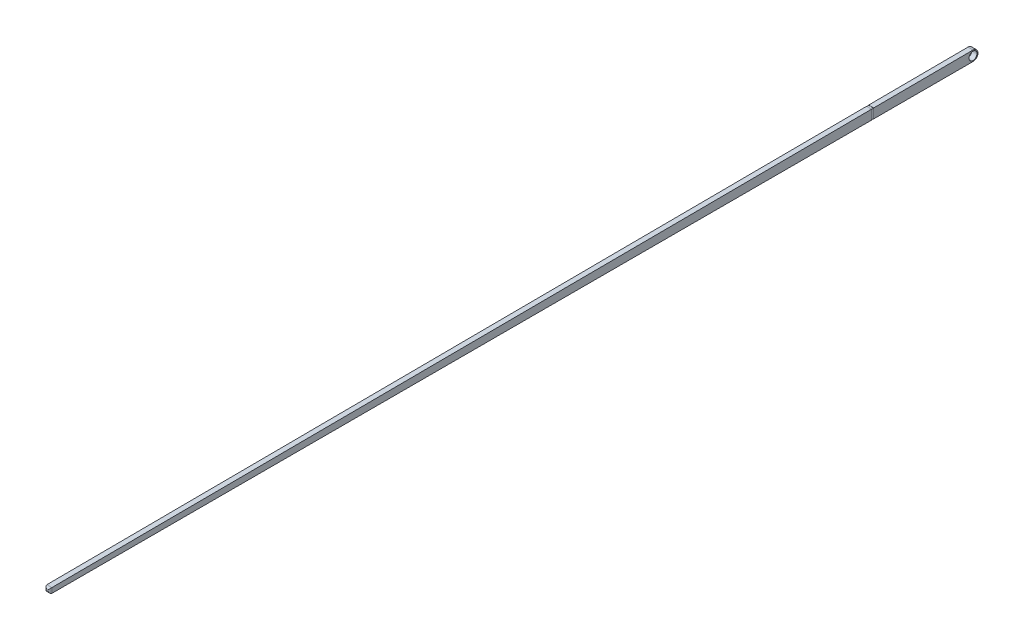
ISO-10303-21;
HEADER;
FILE_DESCRIPTION(('STEP AP214'),'2;1');
FILE_NAME('part.step','',(''),(''),'','','');
FILE_SCHEMA(('AUTOMOTIVE_DESIGN { 1 0 10303 214 1 1 1 1 }'));
ENDSEC;
DATA;
#1=APPLICATION_CONTEXT('core data for automotive mechanical design processes');
#2=APPLICATION_PROTOCOL_DEFINITION('international standard','automotive_design',2000,#1);
#3=PRODUCT_CONTEXT('',#1,'mechanical');
#4=PRODUCT('Part','Part','',(#3));
#5=PRODUCT_RELATED_PRODUCT_CATEGORY('part','',(#4));
#6=PRODUCT_DEFINITION_FORMATION('','',#4);
#7=PRODUCT_DEFINITION_CONTEXT('part definition',#1,'design');
#8=PRODUCT_DEFINITION('design','',#6,#7);
#9=PRODUCT_DEFINITION_SHAPE('','',#8);
#10=(LENGTH_UNIT() NAMED_UNIT(*) SI_UNIT(.MILLI.,.METRE.));
#11=(NAMED_UNIT(*) PLANE_ANGLE_UNIT() SI_UNIT($,.RADIAN.));
#12=(NAMED_UNIT(*) SI_UNIT($,.STERADIAN.) SOLID_ANGLE_UNIT());
#13=UNCERTAINTY_MEASURE_WITH_UNIT(LENGTH_MEASURE(1.E-05),#10,'distance_accuracy_value','');
#14=(GEOMETRIC_REPRESENTATION_CONTEXT(3) GLOBAL_UNCERTAINTY_ASSIGNED_CONTEXT((#13)) GLOBAL_UNIT_ASSIGNED_CONTEXT((#10,
#11,#12)) REPRESENTATION_CONTEXT('',''));
#15=CARTESIAN_POINT('',(0.,0.,0.));
#16=DIRECTION('',(0.,0.,1.));
#17=DIRECTION('',(1.,0.,0.));
#18=AXIS2_PLACEMENT_3D('',#15,#16,#17);
#19=CARTESIAN_POINT('',(0.3175,0.,0.));
#20=DIRECTION('',(-1.,0.,0.));
#21=DIRECTION('',(0.,0.,1.));
#22=AXIS2_PLACEMENT_3D('',#19,#20,#21);
#23=PLANE('',#22);
#24=DIRECTION('',(0.,-1.,0.));
#25=VECTOR('',#24,1.);
#26=CARTESIAN_POINT('',(0.3175,0.,12.827));
#27=LINE('',#26,#25);
#28=CARTESIAN_POINT('',(0.3175,0.56529639208067,12.827));
#29=VERTEX_POINT('',#28);
#30=CARTESIAN_POINT('',(0.3175,-0.635000000000002,12.827));
#31=VERTEX_POINT('',#30);
#32=EDGE_CURVE('E57',#29,#31,#27,.T.);
#33=ORIENTED_EDGE('',*,*,#32,.F.);
#34=DIRECTION('',(0.,-0.00543478260869578,0.999985231459943));
#35=VECTOR('',#34,1.);
#36=CARTESIAN_POINT('',(0.3175,0.634990621977064,0.00345108695652175));
#37=LINE('',#36,#35);
#38=CARTESIAN_POINT('',(0.3175,0.00138045516990203,116.586));
#39=VERTEX_POINT('',#38);
#40=EDGE_CURVE('E214',#29,#39,#37,.T.);
#41=ORIENTED_EDGE('',*,*,#40,.T.);
#42=DIRECTION('',(0.,-1.,0.));
#43=VECTOR('',#42,1.);
#44=CARTESIAN_POINT('',(0.3175,0.,116.586));
#45=LINE('',#44,#43);
#46=CARTESIAN_POINT('',(0.3175,-0.635000000000014,116.586));
#47=VERTEX_POINT('',#46);
#48=EDGE_CURVE('E246',#39,#47,#45,.T.);
#49=ORIENTED_EDGE('',*,*,#48,.T.);
#50=DIRECTION('',(0.,0.,-1.));
#51=VECTOR('',#50,1.);
#52=CARTESIAN_POINT('',(0.3175,-0.635,0.));
#53=LINE('',#52,#51);
#54=EDGE_CURVE('E215',#47,#31,#53,.T.);
#55=ORIENTED_EDGE('',*,*,#54,.T.);
#56=EDGE_LOOP('',(#33,#41,#49,#55));
#57=FACE_BOUND('',#56,.T.);
#58=ADVANCED_FACE('F35',(#57),#23,.F.);
#59=CARTESIAN_POINT('',(-0.3175,0.,0.));
#60=DIRECTION('',(-1.,0.,0.));
#61=DIRECTION('',(0.,0.,1.));
#62=AXIS2_PLACEMENT_3D('',#59,#60,#61);
#63=PLANE('',#62);
#64=DIRECTION('',(0.,-0.00543478260869578,0.999985231459943));
#65=VECTOR('',#64,1.);
#66=CARTESIAN_POINT('',(-0.3175,0.634990621977064,0.00345108695652175));
#67=LINE('',#66,#65);
#68=CARTESIAN_POINT('',(-0.3175,0.56529639208067,12.827));
#69=VERTEX_POINT('',#68);
#70=CARTESIAN_POINT('',(-0.3175,0.00138045516990203,116.586));
#71=VERTEX_POINT('',#70);
#72=EDGE_CURVE('E226',#69,#71,#67,.T.);
#73=ORIENTED_EDGE('',*,*,#72,.F.);
#74=DIRECTION('',(0.,-1.,0.));
#75=VECTOR('',#74,1.);
#76=CARTESIAN_POINT('',(-0.3175,0.,12.827));
#77=LINE('',#76,#75);
#78=CARTESIAN_POINT('',(-0.3175,-0.635000000000002,12.827));
#79=VERTEX_POINT('',#78);
#80=EDGE_CURVE('E180',#69,#79,#77,.T.);
#81=ORIENTED_EDGE('',*,*,#80,.T.);
#82=DIRECTION('',(0.,0.,-1.));
#83=VECTOR('',#82,1.);
#84=CARTESIAN_POINT('',(-0.3175,-0.635,0.));
#85=LINE('',#84,#83);
#86=CARTESIAN_POINT('',(-0.3175,-0.635000000000014,116.586));
#87=VERTEX_POINT('',#86);
#88=EDGE_CURVE('E209',#87,#79,#85,.T.);
#89=ORIENTED_EDGE('',*,*,#88,.F.);
#90=DIRECTION('',(0.,-1.,0.));
#91=VECTOR('',#90,1.);
#92=CARTESIAN_POINT('',(-0.3175,0.,116.586));
#93=LINE('',#92,#91);
#94=EDGE_CURVE('E250',#87,#71,#93,.F.);
#95=ORIENTED_EDGE('',*,*,#94,.T.);
#96=EDGE_LOOP('',(#73,#81,#89,#95));
#97=FACE_BOUND('',#96,.T.);
#98=ADVANCED_FACE('F267',(#97),#63,.T.);
#99=CARTESIAN_POINT('',(0.3175,0.634990621977064,0.00345108695652175));
#100=DIRECTION('',(0.,-0.999985231459943,-0.00543478260869578));
#101=DIRECTION('',(0.,0.00543478260869578,-0.999985231459943));
#102=AXIS2_PLACEMENT_3D('',#99,#100,#101);
#103=PLANE('',#102);
#104=DIRECTION('',(1.,0.,0.));
#105=VECTOR('',#104,1.);
#106=CARTESIAN_POINT('',(0.3175,0.56529639208067,12.827));
#107=LINE('',#106,#105);
#108=EDGE_CURVE('E187',#69,#29,#107,.T.);
#109=ORIENTED_EDGE('',*,*,#108,.F.);
#110=ORIENTED_EDGE('',*,*,#72,.T.);
#111=CARTESIAN_POINT('',(-0.3175,0.00137295269615246,116.587380434783));
#112=VERTEX_POINT('',#111);
#113=EDGE_CURVE('E221',#71,#112,#67,.T.);
#114=ORIENTED_EDGE('',*,*,#113,.T.);
#115=DIRECTION('',(-1.,0.,0.));
#116=VECTOR('',#115,1.);
#117=CARTESIAN_POINT('',(0.3175,0.00137295269615246,116.587380434783));
#118=LINE('',#117,#116);
#119=CARTESIAN_POINT('',(0.3175,0.00137295269615246,116.587380434783));
#120=VERTEX_POINT('',#119);
#121=EDGE_CURVE('E243',#112,#120,#118,.F.);
#122=ORIENTED_EDGE('',*,*,#121,.T.);
#123=EDGE_CURVE('E208',#39,#120,#37,.T.);
#124=ORIENTED_EDGE('',*,*,#123,.F.);
#125=ORIENTED_EDGE('',*,*,#40,.F.);
#126=EDGE_LOOP('',(#109,#110,#114,#122,#124,#125));
#127=FACE_BOUND('',#126,.T.);
#128=ADVANCED_FACE('F291',(#127),#103,.F.);
#129=CARTESIAN_POINT('',(0.3175,-0.635,0.));
#130=DIRECTION('',(0.,1.,0.));
#131=DIRECTION('',(0.,0.,1.));
#132=AXIS2_PLACEMENT_3D('',#129,#130,#131);
#133=PLANE('',#132);
#134=DIRECTION('',(-1.,0.,0.));
#135=VECTOR('',#134,1.);
#136=CARTESIAN_POINT('',(0.3175,-0.635000000000002,12.827));
#137=LINE('',#136,#135);
#138=EDGE_CURVE('E43',#31,#79,#137,.T.);
#139=ORIENTED_EDGE('',*,*,#138,.F.);
#140=ORIENTED_EDGE('',*,*,#54,.F.);
#141=DIRECTION('',(-1.,0.,0.));
#142=VECTOR('',#141,1.);
#143=CARTESIAN_POINT('',(0.3175,-0.635000000000014,116.586));
#144=LINE('',#143,#142);
#145=EDGE_CURVE('E248',#47,#87,#144,.T.);
#146=ORIENTED_EDGE('',*,*,#145,.T.);
#147=ORIENTED_EDGE('',*,*,#88,.T.);
#148=EDGE_LOOP('',(#139,#140,#146,#147));
#149=FACE_BOUND('',#148,.T.);
#150=ADVANCED_FACE('F269',(#149),#133,.F.);
#151=CARTESIAN_POINT('',(0.3175,0.,116.84));
#152=DIRECTION('',(0.,0.,-1.));
#153=DIRECTION('',(-1.,0.,0.));
#154=AXIS2_PLACEMENT_3D('',#151,#152,#153);
#155=PLANE('',#154);
#156=DIRECTION('',(0.,-1.,0.));
#157=VECTOR('',#156,1.);
#158=CARTESIAN_POINT('',(0.0635,0.,116.84));
#159=LINE('',#158,#157);
#160=CARTESIAN_POINT('',(0.0635,-0.381000000000014,116.84));
#161=VERTEX_POINT('',#160);
#162=CARTESIAN_POINT('',(0.0635,-0.252623296094673,116.84));
#163=VERTEX_POINT('',#162);
#164=EDGE_CURVE('E238',#161,#163,#159,.F.);
#165=ORIENTED_EDGE('',*,*,#164,.T.);
#166=DIRECTION('',(-1.,0.,0.));
#167=VECTOR('',#166,1.);
#168=CARTESIAN_POINT('',(0.3175,-0.252623296094673,116.84));
#169=LINE('',#168,#167);
#170=CARTESIAN_POINT('',(-0.0635,-0.252623296094673,116.84));
#171=VERTEX_POINT('',#170);
#172=EDGE_CURVE('E240',#163,#171,#169,.T.);
#173=ORIENTED_EDGE('',*,*,#172,.T.);
#174=DIRECTION('',(0.,-1.,0.));
#175=VECTOR('',#174,1.);
#176=CARTESIAN_POINT('',(-0.0635,-0.635000000000014,116.84));
#177=LINE('',#176,#175);
#178=CARTESIAN_POINT('',(-0.0635,-0.381000000000014,116.84));
#179=VERTEX_POINT('',#178);
#180=EDGE_CURVE('E234',#171,#179,#177,.T.);
#181=ORIENTED_EDGE('',*,*,#180,.T.);
#182=DIRECTION('',(-1.,0.,0.));
#183=VECTOR('',#182,1.);
#184=CARTESIAN_POINT('',(0.3175,-0.381000000000014,116.84));
#185=LINE('',#184,#183);
#186=EDGE_CURVE('E236',#179,#161,#185,.F.);
#187=ORIENTED_EDGE('',*,*,#186,.T.);
#188=EDGE_LOOP('',(#165,#173,#181,#187));
#189=FACE_BOUND('',#188,.T.);
#190=ADVANCED_FACE('F283',(#189),#155,.F.);
#191=CARTESIAN_POINT('',(0.3175,-0.381000000000014,116.586));
#192=DIRECTION('',(-1.,0.,0.));
#193=DIRECTION('',(0.,0.,1.));
#194=AXIS2_PLACEMENT_3D('',#191,#192,#193);
#195=CYLINDRICAL_SURFACE('',#194,0.254);
#196=CARTESIAN_POINT('',(-0.0635,-0.381000000000014,116.586));
#197=DIRECTION('',(-0.707106781186547,0.707106781186547,0.));
#198=DIRECTION('',(0.707106781186547,0.707106781186547,0.));
#199=AXIS2_PLACEMENT_3D('',#196,#197,#198);
#200=ELLIPSE('',#199,0.359210244842766,0.254);
#201=EDGE_CURVE('E256',#87,#179,#200,.T.);
#202=ORIENTED_EDGE('',*,*,#201,.F.);
#203=ORIENTED_EDGE('',*,*,#145,.F.);
#204=CARTESIAN_POINT('',(0.0635,-0.381000000000014,116.586));
#205=DIRECTION('',(-0.707106781186547,-0.707106781186547,0.));
#206=DIRECTION('',(-0.707106781186547,0.707106781186547,0.));
#207=AXIS2_PLACEMENT_3D('',#204,#205,#206);
#208=ELLIPSE('',#207,0.359210244842766,0.254);
#209=EDGE_CURVE('E204',#161,#47,#208,.F.);
#210=ORIENTED_EDGE('',*,*,#209,.F.);
#211=ORIENTED_EDGE('',*,*,#186,.F.);
#212=EDGE_LOOP('',(#202,#203,#210,#211));
#213=FACE_BOUND('',#212,.T.);
#214=ADVANCED_FACE('F37',(#213),#195,.T.);
#215=CARTESIAN_POINT('',(0.0635,0.,116.586));
#216=DIRECTION('',(0.,-1.,0.));
#217=DIRECTION('',(0.,0.,-1.));
#218=AXIS2_PLACEMENT_3D('',#215,#216,#217);
#219=CYLINDRICAL_SURFACE('',#218,0.254);
#220=ORIENTED_EDGE('',*,*,#48,.F.);
#221=ORIENTED_EDGE('',*,*,#123,.T.);
#222=CARTESIAN_POINT('',(0.0635,-0.252623296094673,116.586));
#223=DIRECTION('',(0.707106781186547,-0.707106781186547,0.));
#224=DIRECTION('',(-0.707106781186547,-0.707106781186547,0.));
#225=AXIS2_PLACEMENT_3D('',#222,#223,#224);
#226=ELLIPSE('',#225,0.359210244842766,0.254);
#227=EDGE_CURVE('E254',#163,#120,#226,.F.);
#228=ORIENTED_EDGE('',*,*,#227,.F.);
#229=ORIENTED_EDGE('',*,*,#164,.F.);
#230=ORIENTED_EDGE('',*,*,#209,.T.);
#231=EDGE_LOOP('',(#220,#221,#228,#229,#230));
#232=FACE_BOUND('',#231,.T.);
#233=ADVANCED_FACE('F278',(#232),#219,.T.);
#234=CARTESIAN_POINT('',(-0.0635,0.,116.586));
#235=DIRECTION('',(0.,1.,0.));
#236=DIRECTION('',(0.,0.,1.));
#237=AXIS2_PLACEMENT_3D('',#234,#235,#236);
#238=CYLINDRICAL_SURFACE('',#237,0.254);
#239=ORIENTED_EDGE('',*,*,#201,.T.);
#240=ORIENTED_EDGE('',*,*,#180,.F.);
#241=CARTESIAN_POINT('',(-0.0635,-0.252623296094673,116.586));
#242=DIRECTION('',(0.707106781186547,0.707106781186547,0.));
#243=DIRECTION('',(-0.707106781186547,0.707106781186547,0.));
#244=AXIS2_PLACEMENT_3D('',#241,#242,#243);
#245=ELLIPSE('',#244,0.359210244842766,0.254);
#246=EDGE_CURVE('E196',#112,#171,#245,.T.);
#247=ORIENTED_EDGE('',*,*,#246,.F.);
#248=ORIENTED_EDGE('',*,*,#113,.F.);
#249=ORIENTED_EDGE('',*,*,#94,.F.);
#250=EDGE_LOOP('',(#239,#240,#247,#248,#249));
#251=FACE_BOUND('',#250,.T.);
#252=ADVANCED_FACE('F286',(#251),#238,.T.);
#253=CARTESIAN_POINT('',(0.3175,-0.252623296094673,116.586));
#254=DIRECTION('',(-1.,0.,0.));
#255=DIRECTION('',(0.,0.,1.));
#256=AXIS2_PLACEMENT_3D('',#253,#254,#255);
#257=CYLINDRICAL_SURFACE('',#256,0.254);
#258=ORIENTED_EDGE('',*,*,#227,.T.);
#259=ORIENTED_EDGE('',*,*,#121,.F.);
#260=ORIENTED_EDGE('',*,*,#246,.T.);
#261=ORIENTED_EDGE('',*,*,#172,.F.);
#262=EDGE_LOOP('',(#258,#259,#260,#261));
#263=FACE_BOUND('',#262,.T.);
#264=ADVANCED_FACE('F296',(#263),#257,.T.);
#265=CARTESIAN_POINT('',(0.,0.,12.573));
#266=DIRECTION('',(0.,0.,-1.));
#267=DIRECTION('',(-1.,0.,0.));
#268=AXIS2_PLACEMENT_3D('',#265,#266,#267);
#269=PLANE('',#268);
#270=DIRECTION('',(0.,1.,0.));
#271=VECTOR('',#270,1.);
#272=CARTESIAN_POINT('',(0.3048,-0.609600000000002,12.573));
#273=LINE('',#272,#271);
#274=CARTESIAN_POINT('',(0.3048,-0.609600000000002,12.573));
#275=VERTEX_POINT('',#274);
#276=CARTESIAN_POINT('',(0.3048,0.540586619665628,12.573));
#277=VERTEX_POINT('',#276);
#278=EDGE_CURVE('E158',#275,#277,#273,.T.);
#279=ORIENTED_EDGE('',*,*,#278,.F.);
#280=DIRECTION('',(1.,0.,0.));
#281=VECTOR('',#280,1.);
#282=CARTESIAN_POINT('',(-0.3048,-0.609600000000002,12.573));
#283=LINE('',#282,#281);
#284=CARTESIAN_POINT('',(-0.3048,-0.609600000000002,12.573));
#285=VERTEX_POINT('',#284);
#286=EDGE_CURVE('E152',#285,#275,#283,.T.);
#287=ORIENTED_EDGE('',*,*,#286,.F.);
#288=DIRECTION('',(0.,-1.,0.));
#289=VECTOR('',#288,1.);
#290=CARTESIAN_POINT('',(-0.3048,-0.609600000000002,12.573));
#291=LINE('',#290,#289);
#292=CARTESIAN_POINT('',(-0.3048,0.540586619665628,12.573));
#293=VERTEX_POINT('',#292);
#294=EDGE_CURVE('E161',#293,#285,#291,.T.);
#295=ORIENTED_EDGE('',*,*,#294,.F.);
#296=DIRECTION('',(-1.,0.,0.));
#297=VECTOR('',#296,1.);
#298=CARTESIAN_POINT('',(-0.3048,0.540586619665628,12.573));
#299=LINE('',#298,#297);
#300=EDGE_CURVE('E145',#277,#293,#299,.T.);
#301=ORIENTED_EDGE('',*,*,#300,.F.);
#302=EDGE_LOOP('',(#279,#287,#295,#301));
#303=FACE_BOUND('',#302,.T.);
#304=DIRECTION('',(0.,-1.,0.));
#305=VECTOR('',#304,1.);
#306=CARTESIAN_POINT('',(-0.3175,0.,12.573));
#307=LINE('',#306,#305);
#308=CARTESIAN_POINT('',(-0.3175,0.566676847250586,12.573));
#309=VERTEX_POINT('',#308);
#310=CARTESIAN_POINT('',(-0.3175,-0.635000000000002,12.573));
#311=VERTEX_POINT('',#310);
#312=EDGE_CURVE('E50',#309,#311,#307,.T.);
#313=ORIENTED_EDGE('',*,*,#312,.T.);
#314=DIRECTION('',(-1.,0.,0.));
#315=VECTOR('',#314,1.);
#316=CARTESIAN_POINT('',(0.3175,-0.635000000000002,12.573));
#317=LINE('',#316,#315);
#318=CARTESIAN_POINT('',(0.3175,-0.635000000000002,12.573));
#319=VERTEX_POINT('',#318);
#320=EDGE_CURVE('E11',#319,#311,#317,.T.);
#321=ORIENTED_EDGE('',*,*,#320,.F.);
#322=DIRECTION('',(0.,-1.,0.));
#323=VECTOR('',#322,1.);
#324=CARTESIAN_POINT('',(0.3175,0.,12.573));
#325=LINE('',#324,#323);
#326=CARTESIAN_POINT('',(0.3175,0.566676847250586,12.573));
#327=VERTEX_POINT('',#326);
#328=EDGE_CURVE('E190',#327,#319,#325,.T.);
#329=ORIENTED_EDGE('',*,*,#328,.F.);
#330=DIRECTION('',(1.,0.,0.));
#331=VECTOR('',#330,1.);
#332=CARTESIAN_POINT('',(0.3175,0.566676847250586,12.573));
#333=LINE('',#332,#331);
#334=EDGE_CURVE('E193',#309,#327,#333,.T.);
#335=ORIENTED_EDGE('',*,*,#334,.F.);
#336=EDGE_LOOP('',(#313,#321,#329,#335));
#337=FACE_BOUND('',#336,.T.);
#338=ADVANCED_FACE('F156',(#303,#337),#269,.F.);
#339=CARTESIAN_POINT('',(0.,0.,12.827));
#340=DIRECTION('',(0.,0.,-1.));
#341=DIRECTION('',(-1.,0.,0.));
#342=AXIS2_PLACEMENT_3D('',#339,#340,#341);
#343=PLANE('',#342);
#344=DIRECTION('',(-1.,0.,0.));
#345=VECTOR('',#344,1.);
#346=CARTESIAN_POINT('',(-0.3048,0.540586619665628,12.827));
#347=LINE('',#346,#345);
#348=CARTESIAN_POINT('',(0.3048,0.540586619665628,12.827));
#349=VERTEX_POINT('',#348);
#350=CARTESIAN_POINT('',(-0.3048,0.540586619665628,12.827));
#351=VERTEX_POINT('',#350);
#352=EDGE_CURVE('E147',#349,#351,#347,.T.);
#353=ORIENTED_EDGE('',*,*,#352,.T.);
#354=DIRECTION('',(0.,-1.,0.));
#355=VECTOR('',#354,1.);
#356=CARTESIAN_POINT('',(-0.3048,-0.609600000000002,12.827));
#357=LINE('',#356,#355);
#358=CARTESIAN_POINT('',(-0.3048,-0.609600000000002,12.827));
#359=VERTEX_POINT('',#358);
#360=EDGE_CURVE('E169',#351,#359,#357,.T.);
#361=ORIENTED_EDGE('',*,*,#360,.T.);
#362=DIRECTION('',(1.,0.,0.));
#363=VECTOR('',#362,1.);
#364=CARTESIAN_POINT('',(-0.3048,-0.609600000000002,12.827));
#365=LINE('',#364,#363);
#366=CARTESIAN_POINT('',(0.3048,-0.609600000000002,12.827));
#367=VERTEX_POINT('',#366);
#368=EDGE_CURVE('E166',#359,#367,#365,.T.);
#369=ORIENTED_EDGE('',*,*,#368,.T.);
#370=DIRECTION('',(0.,1.,0.));
#371=VECTOR('',#370,1.);
#372=CARTESIAN_POINT('',(0.3048,-0.609600000000002,12.827));
#373=LINE('',#372,#371);
#374=EDGE_CURVE('E174',#367,#349,#373,.T.);
#375=ORIENTED_EDGE('',*,*,#374,.T.);
#376=EDGE_LOOP('',(#353,#361,#369,#375));
#377=FACE_BOUND('',#376,.T.);
#378=ORIENTED_EDGE('',*,*,#108,.T.);
#379=ORIENTED_EDGE('',*,*,#32,.T.);
#380=ORIENTED_EDGE('',*,*,#138,.T.);
#381=ORIENTED_EDGE('',*,*,#80,.F.);
#382=EDGE_LOOP('',(#378,#379,#380,#381));
#383=FACE_BOUND('',#382,.T.);
#384=ADVANCED_FACE('F260',(#377,#383),#343,.T.);
#385=CARTESIAN_POINT('',(0.3048,-0.609600000000002,12.573));
#386=DIRECTION('',(1.,0.,0.));
#387=DIRECTION('',(0.,1.,0.));
#388=AXIS2_PLACEMENT_3D('',#385,#386,#387);
#389=PLANE('',#388);
#390=ORIENTED_EDGE('',*,*,#374,.F.);
#391=DIRECTION('',(0.,0.,1.));
#392=VECTOR('',#391,1.);
#393=CARTESIAN_POINT('',(0.3048,-0.609600000000002,12.573));
#394=LINE('',#393,#392);
#395=EDGE_CURVE('E165',#275,#367,#394,.T.);
#396=ORIENTED_EDGE('',*,*,#395,.F.);
#397=ORIENTED_EDGE('',*,*,#278,.T.);
#398=DIRECTION('',(0.,0.,1.));
#399=VECTOR('',#398,1.);
#400=CARTESIAN_POINT('',(0.3048,0.540586619665628,12.573));
#401=LINE('',#400,#399);
#402=EDGE_CURVE('E142',#277,#349,#401,.T.);
#403=ORIENTED_EDGE('',*,*,#402,.T.);
#404=EDGE_LOOP('',(#390,#396,#397,#403));
#405=FACE_BOUND('',#404,.T.);
#406=ADVANCED_FACE('F164',(#405),#389,.T.);
#407=CARTESIAN_POINT('',(-0.3048,-0.609600000000002,12.573));
#408=DIRECTION('',(0.,-1.,0.));
#409=DIRECTION('',(0.,0.,-1.));
#410=AXIS2_PLACEMENT_3D('',#407,#408,#409);
#411=PLANE('',#410);
#412=ORIENTED_EDGE('',*,*,#368,.F.);
#413=DIRECTION('',(0.,0.,1.));
#414=VECTOR('',#413,1.);
#415=CARTESIAN_POINT('',(-0.3048,-0.609600000000002,12.573));
#416=LINE('',#415,#414);
#417=EDGE_CURVE('E181',#285,#359,#416,.T.);
#418=ORIENTED_EDGE('',*,*,#417,.F.);
#419=ORIENTED_EDGE('',*,*,#286,.T.);
#420=ORIENTED_EDGE('',*,*,#395,.T.);
#421=EDGE_LOOP('',(#412,#418,#419,#420));
#422=FACE_BOUND('',#421,.T.);
#423=ADVANCED_FACE('F344',(#422),#411,.T.);
#424=CARTESIAN_POINT('',(-0.3048,-0.609600000000002,12.573));
#425=DIRECTION('',(-1.,0.,0.));
#426=DIRECTION('',(0.,-1.,0.));
#427=AXIS2_PLACEMENT_3D('',#424,#425,#426);
#428=PLANE('',#427);
#429=ORIENTED_EDGE('',*,*,#360,.F.);
#430=DIRECTION('',(0.,0.,1.));
#431=VECTOR('',#430,1.);
#432=CARTESIAN_POINT('',(-0.3048,0.540586619665628,12.573));
#433=LINE('',#432,#431);
#434=EDGE_CURVE('E151',#293,#351,#433,.T.);
#435=ORIENTED_EDGE('',*,*,#434,.F.);
#436=ORIENTED_EDGE('',*,*,#294,.T.);
#437=ORIENTED_EDGE('',*,*,#417,.T.);
#438=EDGE_LOOP('',(#429,#435,#436,#437));
#439=FACE_BOUND('',#438,.T.);
#440=ADVANCED_FACE('F337',(#439),#428,.T.);
#441=CARTESIAN_POINT('',(-0.3048,0.540586619665628,12.573));
#442=DIRECTION('',(0.,1.,0.));
#443=DIRECTION('',(0.,0.,1.));
#444=AXIS2_PLACEMENT_3D('',#441,#442,#443);
#445=PLANE('',#444);
#446=ORIENTED_EDGE('',*,*,#352,.F.);
#447=ORIENTED_EDGE('',*,*,#402,.F.);
#448=ORIENTED_EDGE('',*,*,#300,.T.);
#449=ORIENTED_EDGE('',*,*,#434,.T.);
#450=EDGE_LOOP('',(#446,#447,#448,#449));
#451=FACE_BOUND('',#450,.T.);
#452=ADVANCED_FACE('F144',(#451),#445,.T.);
#453=CARTESIAN_POINT('',(0.3175,0.,0.));
#454=DIRECTION('',(-1.,0.,0.));
#455=DIRECTION('',(0.,0.,1.));
#456=AXIS2_PLACEMENT_3D('',#453,#454,#455);
#457=CYLINDRICAL_SURFACE('',#456,0.508);
#458=CARTESIAN_POINT('',(0.3175,0.,0.));
#459=DIRECTION('',(1.,0.,0.));
#460=DIRECTION('',(0.,0.,-1.));
#461=AXIS2_PLACEMENT_3D('',#458,#459,#460);
#462=CIRCLE('',#461,0.508);
#463=CARTESIAN_POINT('',(0.3175,0.,-0.508));
#464=VERTEX_POINT('',#463);
#465=EDGE_CURVE('E197',#464,#464,#462,.T.);
#466=ORIENTED_EDGE('',*,*,#465,.T.);
#467=EDGE_LOOP('',(#466));
#468=FACE_BOUND('',#467,.T.);
#469=CARTESIAN_POINT('',(-0.3175,0.,0.));
#470=DIRECTION('',(1.,0.,0.));
#471=DIRECTION('',(0.,0.,-1.));
#472=AXIS2_PLACEMENT_3D('',#469,#470,#471);
#473=CIRCLE('',#472,0.508);
#474=CARTESIAN_POINT('',(-0.3175,0.,-0.508));
#475=VERTEX_POINT('',#474);
#476=EDGE_CURVE('E201',#475,#475,#473,.T.);
#477=ORIENTED_EDGE('',*,*,#476,.F.);
#478=EDGE_LOOP('',(#477));
#479=FACE_BOUND('',#478,.T.);
#480=ADVANCED_FACE('F325',(#468,#479),#457,.F.);
#481=CARTESIAN_POINT('',(0.3175,0.,0.));
#482=DIRECTION('',(-1.,0.,0.));
#483=DIRECTION('',(0.,0.,1.));
#484=AXIS2_PLACEMENT_3D('',#481,#482,#483);
#485=CYLINDRICAL_SURFACE('',#484,0.635);
#486=CARTESIAN_POINT('',(-0.3175,0.,0.));
#487=DIRECTION('',(1.,0.,0.));
#488=DIRECTION('',(0.,0.,1.));
#489=AXIS2_PLACEMENT_3D('',#486,#487,#488);
#490=CIRCLE('',#489,0.635);
#491=CARTESIAN_POINT('',(-0.3175,-0.635,0.));
#492=VERTEX_POINT('',#491);
#493=CARTESIAN_POINT('',(-0.3175,0.634990621977064,0.00345108695652175));
#494=VERTEX_POINT('',#493);
#495=EDGE_CURVE('E200',#492,#494,#490,.T.);
#496=ORIENTED_EDGE('',*,*,#495,.T.);
#497=DIRECTION('',(-1.,0.,0.));
#498=VECTOR('',#497,1.);
#499=CARTESIAN_POINT('',(0.3175,0.634990621977064,0.00345108695652175));
#500=LINE('',#499,#498);
#501=CARTESIAN_POINT('',(0.3175,0.634990621977064,0.00345108695652175));
#502=VERTEX_POINT('',#501);
#503=EDGE_CURVE('E231',#502,#494,#500,.T.);
#504=ORIENTED_EDGE('',*,*,#503,.F.);
#505=CARTESIAN_POINT('',(0.3175,0.,0.));
#506=DIRECTION('',(1.,0.,0.));
#507=DIRECTION('',(0.,0.,1.));
#508=AXIS2_PLACEMENT_3D('',#505,#506,#507);
#509=CIRCLE('',#508,0.635);
#510=CARTESIAN_POINT('',(0.3175,-0.635,0.));
#511=VERTEX_POINT('',#510);
#512=EDGE_CURVE('E205',#511,#502,#509,.T.);
#513=ORIENTED_EDGE('',*,*,#512,.F.);
#514=DIRECTION('',(-1.,0.,0.));
#515=VECTOR('',#514,1.);
#516=CARTESIAN_POINT('',(0.3175,-0.635,0.));
#517=LINE('',#516,#515);
#518=EDGE_CURVE('E218',#511,#492,#517,.T.);
#519=ORIENTED_EDGE('',*,*,#518,.T.);
#520=EDGE_LOOP('',(#496,#504,#513,#519));
#521=FACE_BOUND('',#520,.T.);
#522=ADVANCED_FACE('F328',(#521),#485,.T.);
#523=EDGE_CURVE('E213',#319,#511,#53,.T.);
#524=ORIENTED_EDGE('',*,*,#523,.F.);
#525=ORIENTED_EDGE('',*,*,#320,.T.);
#526=EDGE_CURVE('E225',#311,#492,#85,.T.);
#527=ORIENTED_EDGE('',*,*,#526,.T.);
#528=ORIENTED_EDGE('',*,*,#518,.F.);
#529=EDGE_LOOP('',(#524,#525,#527,#528));
#530=FACE_BOUND('',#529,.T.);
#531=ADVANCED_FACE('F335',(#530),#133,.F.);
#532=EDGE_CURVE('E222',#494,#309,#67,.T.);
#533=ORIENTED_EDGE('',*,*,#532,.T.);
#534=ORIENTED_EDGE('',*,*,#334,.T.);
#535=EDGE_CURVE('E210',#502,#327,#37,.T.);
#536=ORIENTED_EDGE('',*,*,#535,.F.);
#537=ORIENTED_EDGE('',*,*,#503,.T.);
#538=EDGE_LOOP('',(#533,#534,#536,#537));
#539=FACE_BOUND('',#538,.T.);
#540=ADVANCED_FACE('F320',(#539),#103,.F.);
#541=ORIENTED_EDGE('',*,*,#312,.F.);
#542=ORIENTED_EDGE('',*,*,#532,.F.);
#543=ORIENTED_EDGE('',*,*,#495,.F.);
#544=ORIENTED_EDGE('',*,*,#526,.F.);
#545=EDGE_LOOP('',(#541,#542,#543,#544));
#546=FACE_BOUND('',#545,.T.);
#547=ORIENTED_EDGE('',*,*,#476,.T.);
#548=EDGE_LOOP('',(#547));
#549=FACE_BOUND('',#548,.T.);
#550=ADVANCED_FACE('F313',(#546,#549),#63,.T.);
#551=ORIENTED_EDGE('',*,*,#535,.T.);
#552=ORIENTED_EDGE('',*,*,#328,.T.);
#553=ORIENTED_EDGE('',*,*,#523,.T.);
#554=ORIENTED_EDGE('',*,*,#512,.T.);
#555=EDGE_LOOP('',(#551,#552,#553,#554));
#556=FACE_BOUND('',#555,.T.);
#557=ORIENTED_EDGE('',*,*,#465,.F.);
#558=EDGE_LOOP('',(#557));
#559=FACE_BOUND('',#558,.T.);
#560=ADVANCED_FACE('F308',(#556,#559),#23,.F.);
#561=CLOSED_SHELL('',(#58,#98,#128,#150,#190,#214,#233,#252,#264,#338,#384,#406,#423,#440,#452,
#480,#522,#531,#540,#550,#560));
#562=MANIFOLD_SOLID_BREP('B2',#561);
#563=ADVANCED_BREP_SHAPE_REPRESENTATION('',(#18,#562),#14);
#564=SHAPE_DEFINITION_REPRESENTATION(#9,#563);
ENDSEC;
END-ISO-10303-21;
